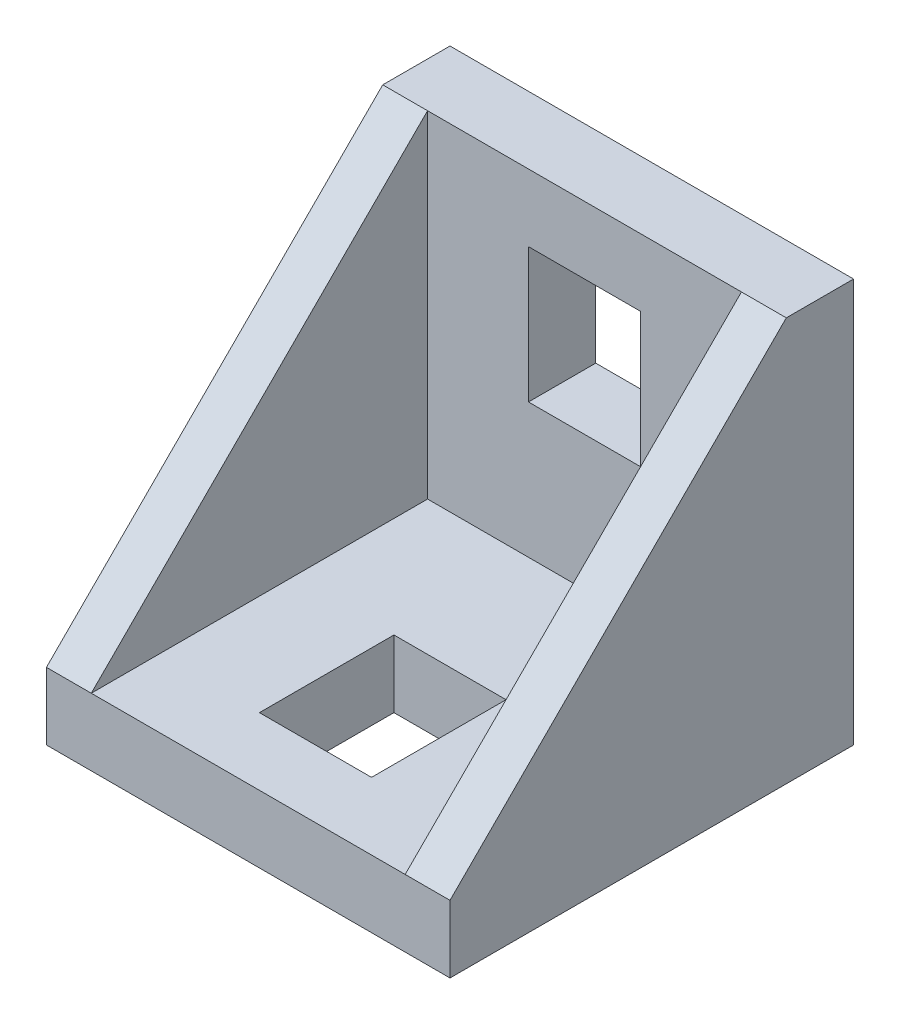
ISO-10303-21;
HEADER;
FILE_DESCRIPTION(('STEP AP214'),'2;1');
FILE_NAME('part.step','',(''),(''),'','','');
FILE_SCHEMA(('AUTOMOTIVE_DESIGN { 1 0 10303 214 1 1 1 1 }'));
ENDSEC;
DATA;
#1=APPLICATION_CONTEXT('core data for automotive mechanical design processes');
#2=APPLICATION_PROTOCOL_DEFINITION('international standard','automotive_design',2000,#1);
#3=PRODUCT_CONTEXT('',#1,'mechanical');
#4=PRODUCT('Part','Part','',(#3));
#5=PRODUCT_RELATED_PRODUCT_CATEGORY('part','',(#4));
#6=PRODUCT_DEFINITION_FORMATION('','',#4);
#7=PRODUCT_DEFINITION_CONTEXT('part definition',#1,'design');
#8=PRODUCT_DEFINITION('design','',#6,#7);
#9=PRODUCT_DEFINITION_SHAPE('','',#8);
#10=(LENGTH_UNIT() NAMED_UNIT(*) SI_UNIT(.MILLI.,.METRE.));
#11=(NAMED_UNIT(*) PLANE_ANGLE_UNIT() SI_UNIT($,.RADIAN.));
#12=(NAMED_UNIT(*) SI_UNIT($,.STERADIAN.) SOLID_ANGLE_UNIT());
#13=UNCERTAINTY_MEASURE_WITH_UNIT(LENGTH_MEASURE(1.E-05),#10,'distance_accuracy_value','');
#14=(GEOMETRIC_REPRESENTATION_CONTEXT(3) GLOBAL_UNCERTAINTY_ASSIGNED_CONTEXT((#13)) GLOBAL_UNIT_ASSIGNED_CONTEXT((#10,
#11,#12)) REPRESENTATION_CONTEXT('',''));
#15=CARTESIAN_POINT('',(0.,0.,0.));
#16=DIRECTION('',(0.,0.,1.));
#17=DIRECTION('',(1.,0.,0.));
#18=AXIS2_PLACEMENT_3D('',#15,#16,#17);
#19=CARTESIAN_POINT('',(0.,18.,3.));
#20=DIRECTION('',(0.,0.,-1.));
#21=DIRECTION('',(-1.,0.,0.));
#22=AXIS2_PLACEMENT_3D('',#19,#20,#21);
#23=PLANE('',#22);
#24=DIRECTION('',(-1.,0.,0.));
#25=VECTOR('',#24,1.);
#26=CARTESIAN_POINT('',(11.5,15.,3.));
#27=LINE('',#26,#25);
#28=CARTESIAN_POINT('',(11.5,15.,3.));
#29=VERTEX_POINT('',#28);
#30=CARTESIAN_POINT('',(6.5,15.,3.));
#31=VERTEX_POINT('',#30);
#32=EDGE_CURVE('E164',#29,#31,#27,.T.);
#33=ORIENTED_EDGE('',*,*,#32,.F.);
#34=DIRECTION('',(0.,1.,0.));
#35=VECTOR('',#34,1.);
#36=CARTESIAN_POINT('',(11.5,15.,3.));
#37=LINE('',#36,#35);
#38=CARTESIAN_POINT('',(11.5,9.,3.));
#39=VERTEX_POINT('',#38);
#40=EDGE_CURVE('E47',#39,#29,#37,.T.);
#41=ORIENTED_EDGE('',*,*,#40,.F.);
#42=DIRECTION('',(1.,0.,0.));
#43=VECTOR('',#42,1.);
#44=CARTESIAN_POINT('',(11.5,9.,3.));
#45=LINE('',#44,#43);
#46=CARTESIAN_POINT('',(6.5,9.,3.));
#47=VERTEX_POINT('',#46);
#48=EDGE_CURVE('E157',#47,#39,#45,.T.);
#49=ORIENTED_EDGE('',*,*,#48,.F.);
#50=DIRECTION('',(0.,-1.,0.));
#51=VECTOR('',#50,1.);
#52=CARTESIAN_POINT('',(6.5,9.,3.));
#53=LINE('',#52,#51);
#54=EDGE_CURVE('E171',#31,#47,#53,.T.);
#55=ORIENTED_EDGE('',*,*,#54,.F.);
#56=EDGE_LOOP('',(#33,#41,#49,#55));
#57=FACE_BOUND('',#56,.T.);
#58=DIRECTION('',(0.,-1.,0.));
#59=VECTOR('',#58,1.);
#60=CARTESIAN_POINT('',(2.,3.,3.));
#61=LINE('',#60,#59);
#62=CARTESIAN_POINT('',(2.,18.,3.));
#63=VERTEX_POINT('',#62);
#64=CARTESIAN_POINT('',(2.,3.,3.));
#65=VERTEX_POINT('',#64);
#66=EDGE_CURVE('E211',#63,#65,#61,.T.);
#67=ORIENTED_EDGE('',*,*,#66,.T.);
#68=DIRECTION('',(-1.,0.,0.));
#69=VECTOR('',#68,1.);
#70=CARTESIAN_POINT('',(0.,3.,3.));
#71=LINE('',#70,#69);
#72=CARTESIAN_POINT('',(16.,3.,3.));
#73=VERTEX_POINT('',#72);
#74=EDGE_CURVE('E34',#73,#65,#71,.T.);
#75=ORIENTED_EDGE('',*,*,#74,.F.);
#76=DIRECTION('',(0.,1.,0.));
#77=VECTOR('',#76,1.);
#78=CARTESIAN_POINT('',(16.,3.,3.));
#79=LINE('',#78,#77);
#80=CARTESIAN_POINT('',(16.,18.,3.));
#81=VERTEX_POINT('',#80);
#82=EDGE_CURVE('E228',#73,#81,#79,.T.);
#83=ORIENTED_EDGE('',*,*,#82,.T.);
#84=DIRECTION('',(-1.,0.,0.));
#85=VECTOR('',#84,1.);
#86=CARTESIAN_POINT('',(0.,18.,3.));
#87=LINE('',#86,#85);
#88=EDGE_CURVE('E257',#81,#63,#87,.T.);
#89=ORIENTED_EDGE('',*,*,#88,.T.);
#90=EDGE_LOOP('',(#67,#75,#83,#89));
#91=FACE_BOUND('',#90,.T.);
#92=ADVANCED_FACE('F30',(#57,#91),#23,.F.);
#93=CARTESIAN_POINT('',(0.,3.,18.));
#94=DIRECTION('',(0.,-1.,0.));
#95=DIRECTION('',(0.,0.,-1.));
#96=AXIS2_PLACEMENT_3D('',#93,#94,#95);
#97=PLANE('',#96);
#98=DIRECTION('',(0.,0.,-1.));
#99=VECTOR('',#98,1.);
#100=CARTESIAN_POINT('',(11.5,3.,9.));
#101=LINE('',#100,#99);
#102=CARTESIAN_POINT('',(11.5,3.,15.));
#103=VERTEX_POINT('',#102);
#104=CARTESIAN_POINT('',(11.5,3.,9.));
#105=VERTEX_POINT('',#104);
#106=EDGE_CURVE('E189',#103,#105,#101,.T.);
#107=ORIENTED_EDGE('',*,*,#106,.F.);
#108=DIRECTION('',(1.,0.,0.));
#109=VECTOR('',#108,1.);
#110=CARTESIAN_POINT('',(11.5,3.,15.));
#111=LINE('',#110,#109);
#112=CARTESIAN_POINT('',(6.5,3.,15.));
#113=VERTEX_POINT('',#112);
#114=EDGE_CURVE('E187',#113,#103,#111,.T.);
#115=ORIENTED_EDGE('',*,*,#114,.F.);
#116=DIRECTION('',(0.,0.,1.));
#117=VECTOR('',#116,1.);
#118=CARTESIAN_POINT('',(6.5,3.,15.));
#119=LINE('',#118,#117);
#120=CARTESIAN_POINT('',(6.5,3.,9.));
#121=VERTEX_POINT('',#120);
#122=EDGE_CURVE('E195',#121,#113,#119,.T.);
#123=ORIENTED_EDGE('',*,*,#122,.F.);
#124=DIRECTION('',(-1.,0.,0.));
#125=VECTOR('',#124,1.);
#126=CARTESIAN_POINT('',(11.5,3.,9.));
#127=LINE('',#126,#125);
#128=EDGE_CURVE('E192',#105,#121,#127,.T.);
#129=ORIENTED_EDGE('',*,*,#128,.F.);
#130=EDGE_LOOP('',(#107,#115,#123,#129));
#131=FACE_BOUND('',#130,.T.);
#132=DIRECTION('',(0.,0.,1.));
#133=VECTOR('',#132,1.);
#134=CARTESIAN_POINT('',(2.,3.,18.));
#135=LINE('',#134,#133);
#136=CARTESIAN_POINT('',(2.,3.,18.));
#137=VERTEX_POINT('',#136);
#138=EDGE_CURVE('E214',#65,#137,#135,.T.);
#139=ORIENTED_EDGE('',*,*,#138,.T.);
#140=DIRECTION('',(-1.,0.,0.));
#141=VECTOR('',#140,1.);
#142=CARTESIAN_POINT('',(0.,3.,18.));
#143=LINE('',#142,#141);
#144=CARTESIAN_POINT('',(16.,3.,18.));
#145=VERTEX_POINT('',#144);
#146=EDGE_CURVE('E248',#145,#137,#143,.T.);
#147=ORIENTED_EDGE('',*,*,#146,.F.);
#148=DIRECTION('',(0.,0.,-1.));
#149=VECTOR('',#148,1.);
#150=CARTESIAN_POINT('',(16.,3.,18.));
#151=LINE('',#150,#149);
#152=EDGE_CURVE('E234',#145,#73,#151,.T.);
#153=ORIENTED_EDGE('',*,*,#152,.T.);
#154=ORIENTED_EDGE('',*,*,#74,.T.);
#155=EDGE_LOOP('',(#139,#147,#153,#154));
#156=FACE_BOUND('',#155,.T.);
#157=ADVANCED_FACE('F296',(#131,#156),#97,.F.);
#158=CARTESIAN_POINT('',(0.,0.,3.));
#159=DIRECTION('',(1.,0.,0.));
#160=DIRECTION('',(0.,0.,-1.));
#161=AXIS2_PLACEMENT_3D('',#158,#159,#160);
#162=PLANE('',#161);
#163=DIRECTION('',(0.,-1.,0.));
#164=VECTOR('',#163,1.);
#165=CARTESIAN_POINT('',(0.,0.,0.));
#166=LINE('',#165,#164);
#167=CARTESIAN_POINT('',(0.,18.,0.));
#168=VERTEX_POINT('',#167);
#169=CARTESIAN_POINT('',(0.,0.,0.));
#170=VERTEX_POINT('',#169);
#171=EDGE_CURVE('E251',#168,#170,#166,.T.);
#172=ORIENTED_EDGE('',*,*,#171,.T.);
#173=DIRECTION('',(0.,0.,-1.));
#174=VECTOR('',#173,1.);
#175=CARTESIAN_POINT('',(0.,0.,3.));
#176=LINE('',#175,#174);
#177=CARTESIAN_POINT('',(0.,0.,18.));
#178=VERTEX_POINT('',#177);
#179=EDGE_CURVE('E11',#178,#170,#176,.T.);
#180=ORIENTED_EDGE('',*,*,#179,.F.);
#181=DIRECTION('',(0.,-1.,0.));
#182=VECTOR('',#181,1.);
#183=CARTESIAN_POINT('',(0.,0.,18.));
#184=LINE('',#183,#182);
#185=CARTESIAN_POINT('',(0.,3.,18.));
#186=VERTEX_POINT('',#185);
#187=EDGE_CURVE('E239',#186,#178,#184,.T.);
#188=ORIENTED_EDGE('',*,*,#187,.F.);
#189=DIRECTION('',(0.,0.707106781186547,-0.707106781186547));
#190=VECTOR('',#189,1.);
#191=CARTESIAN_POINT('',(0.,18.,3.));
#192=LINE('',#191,#190);
#193=CARTESIAN_POINT('',(0.,18.,3.));
#194=VERTEX_POINT('',#193);
#195=EDGE_CURVE('E210',#186,#194,#192,.T.);
#196=ORIENTED_EDGE('',*,*,#195,.T.);
#197=DIRECTION('',(0.,0.,-1.));
#198=VECTOR('',#197,1.);
#199=CARTESIAN_POINT('',(0.,18.,3.));
#200=LINE('',#199,#198);
#201=EDGE_CURVE('E256',#194,#168,#200,.T.);
#202=ORIENTED_EDGE('',*,*,#201,.T.);
#203=EDGE_LOOP('',(#172,#180,#188,#196,#202));
#204=FACE_BOUND('',#203,.T.);
#205=ADVANCED_FACE('F32',(#204),#162,.F.);
#206=CARTESIAN_POINT('',(0.,0.,3.));
#207=DIRECTION('',(0.,1.,0.));
#208=DIRECTION('',(0.,0.,1.));
#209=AXIS2_PLACEMENT_3D('',#206,#207,#208);
#210=PLANE('',#209);
#211=DIRECTION('',(0.,0.,-1.));
#212=VECTOR('',#211,1.);
#213=CARTESIAN_POINT('',(6.5,0.,15.));
#214=LINE('',#213,#212);
#215=CARTESIAN_POINT('',(6.5,0.,15.));
#216=VERTEX_POINT('',#215);
#217=CARTESIAN_POINT('',(6.5,0.,9.));
#218=VERTEX_POINT('',#217);
#219=EDGE_CURVE('E181',#216,#218,#214,.T.);
#220=ORIENTED_EDGE('',*,*,#219,.F.);
#221=DIRECTION('',(-1.,0.,0.));
#222=VECTOR('',#221,1.);
#223=CARTESIAN_POINT('',(11.5,0.,15.));
#224=LINE('',#223,#222);
#225=CARTESIAN_POINT('',(11.5,0.,15.));
#226=VERTEX_POINT('',#225);
#227=EDGE_CURVE('E184',#226,#216,#224,.T.);
#228=ORIENTED_EDGE('',*,*,#227,.F.);
#229=DIRECTION('',(0.,0.,1.));
#230=VECTOR('',#229,1.);
#231=CARTESIAN_POINT('',(11.5,0.,9.));
#232=LINE('',#231,#230);
#233=CARTESIAN_POINT('',(11.5,0.,9.));
#234=VERTEX_POINT('',#233);
#235=EDGE_CURVE('E201',#234,#226,#232,.T.);
#236=ORIENTED_EDGE('',*,*,#235,.F.);
#237=DIRECTION('',(1.,0.,0.));
#238=VECTOR('',#237,1.);
#239=CARTESIAN_POINT('',(11.5,0.,9.));
#240=LINE('',#239,#238);
#241=EDGE_CURVE('E151',#218,#234,#240,.T.);
#242=ORIENTED_EDGE('',*,*,#241,.F.);
#243=EDGE_LOOP('',(#220,#228,#236,#242));
#244=FACE_BOUND('',#243,.T.);
#245=DIRECTION('',(1.,0.,0.));
#246=VECTOR('',#245,1.);
#247=CARTESIAN_POINT('',(0.,0.,0.));
#248=LINE('',#247,#246);
#249=CARTESIAN_POINT('',(18.,0.,0.));
#250=VERTEX_POINT('',#249);
#251=EDGE_CURVE('E260',#170,#250,#248,.T.);
#252=ORIENTED_EDGE('',*,*,#251,.T.);
#253=DIRECTION('',(0.,0.,-1.));
#254=VECTOR('',#253,1.);
#255=CARTESIAN_POINT('',(18.,0.,3.));
#256=LINE('',#255,#254);
#257=CARTESIAN_POINT('',(18.,0.,18.));
#258=VERTEX_POINT('',#257);
#259=EDGE_CURVE('E40',#258,#250,#256,.T.);
#260=ORIENTED_EDGE('',*,*,#259,.F.);
#261=DIRECTION('',(1.,0.,0.));
#262=VECTOR('',#261,1.);
#263=CARTESIAN_POINT('',(0.,0.,18.));
#264=LINE('',#263,#262);
#265=EDGE_CURVE('E242',#178,#258,#264,.T.);
#266=ORIENTED_EDGE('',*,*,#265,.F.);
#267=ORIENTED_EDGE('',*,*,#179,.T.);
#268=EDGE_LOOP('',(#252,#260,#266,#267));
#269=FACE_BOUND('',#268,.T.);
#270=ADVANCED_FACE('F332',(#244,#269),#210,.F.);
#271=CARTESIAN_POINT('',(18.,0.,3.));
#272=DIRECTION('',(-1.,0.,0.));
#273=DIRECTION('',(0.,0.,1.));
#274=AXIS2_PLACEMENT_3D('',#271,#272,#273);
#275=PLANE('',#274);
#276=DIRECTION('',(0.,0.,-1.));
#277=VECTOR('',#276,1.);
#278=CARTESIAN_POINT('',(18.,18.,3.));
#279=LINE('',#278,#277);
#280=CARTESIAN_POINT('',(18.,18.,3.));
#281=VERTEX_POINT('',#280);
#282=CARTESIAN_POINT('',(18.,18.,0.));
#283=VERTEX_POINT('',#282);
#284=EDGE_CURVE('E268',#281,#283,#279,.T.);
#285=ORIENTED_EDGE('',*,*,#284,.F.);
#286=DIRECTION('',(0.,-0.707106781186547,0.707106781186547));
#287=VECTOR('',#286,1.);
#288=CARTESIAN_POINT('',(18.,18.,3.));
#289=LINE('',#288,#287);
#290=CARTESIAN_POINT('',(18.,3.,18.));
#291=VERTEX_POINT('',#290);
#292=EDGE_CURVE('E225',#281,#291,#289,.T.);
#293=ORIENTED_EDGE('',*,*,#292,.T.);
#294=DIRECTION('',(0.,1.,0.));
#295=VECTOR('',#294,1.);
#296=CARTESIAN_POINT('',(18.,0.,18.));
#297=LINE('',#296,#295);
#298=EDGE_CURVE('E245',#258,#291,#297,.T.);
#299=ORIENTED_EDGE('',*,*,#298,.F.);
#300=ORIENTED_EDGE('',*,*,#259,.T.);
#301=DIRECTION('',(0.,1.,0.));
#302=VECTOR('',#301,1.);
#303=CARTESIAN_POINT('',(18.,0.,0.));
#304=LINE('',#303,#302);
#305=EDGE_CURVE('E262',#250,#283,#304,.T.);
#306=ORIENTED_EDGE('',*,*,#305,.T.);
#307=EDGE_LOOP('',(#285,#293,#299,#300,#306));
#308=FACE_BOUND('',#307,.T.);
#309=ADVANCED_FACE('F276',(#308),#275,.F.);
#310=CARTESIAN_POINT('',(0.,18.,3.));
#311=DIRECTION('',(0.,-1.,0.));
#312=DIRECTION('',(0.,0.,-1.));
#313=AXIS2_PLACEMENT_3D('',#310,#311,#312);
#314=PLANE('',#313);
#315=DIRECTION('',(-1.,0.,0.));
#316=VECTOR('',#315,1.);
#317=CARTESIAN_POINT('',(0.,18.,0.));
#318=LINE('',#317,#316);
#319=EDGE_CURVE('E264',#283,#168,#318,.T.);
#320=ORIENTED_EDGE('',*,*,#319,.T.);
#321=ORIENTED_EDGE('',*,*,#201,.F.);
#322=DIRECTION('',(-1.,0.,0.));
#323=VECTOR('',#322,1.);
#324=CARTESIAN_POINT('',(2.,18.,3.));
#325=LINE('',#324,#323);
#326=EDGE_CURVE('E223',#63,#194,#325,.T.);
#327=ORIENTED_EDGE('',*,*,#326,.F.);
#328=ORIENTED_EDGE('',*,*,#88,.F.);
#329=EDGE_CURVE('E254',#281,#81,#87,.T.);
#330=ORIENTED_EDGE('',*,*,#329,.F.);
#331=ORIENTED_EDGE('',*,*,#284,.T.);
#332=EDGE_LOOP('',(#320,#321,#327,#328,#330,#331));
#333=FACE_BOUND('',#332,.T.);
#334=ADVANCED_FACE('F283',(#333),#314,.F.);
#335=CARTESIAN_POINT('',(0.,18.,0.));
#336=DIRECTION('',(0.,0.,-1.));
#337=DIRECTION('',(-1.,0.,0.));
#338=AXIS2_PLACEMENT_3D('',#335,#336,#337);
#339=PLANE('',#338);
#340=DIRECTION('',(0.,1.,0.));
#341=VECTOR('',#340,1.);
#342=CARTESIAN_POINT('',(11.5,15.,0.));
#343=LINE('',#342,#341);
#344=CARTESIAN_POINT('',(11.5,9.,0.));
#345=VERTEX_POINT('',#344);
#346=CARTESIAN_POINT('',(11.5,15.,0.));
#347=VERTEX_POINT('',#346);
#348=EDGE_CURVE('E155',#345,#347,#343,.T.);
#349=ORIENTED_EDGE('',*,*,#348,.T.);
#350=DIRECTION('',(-1.,0.,0.));
#351=VECTOR('',#350,1.);
#352=CARTESIAN_POINT('',(11.5,15.,0.));
#353=LINE('',#352,#351);
#354=CARTESIAN_POINT('',(6.5,15.,0.));
#355=VERTEX_POINT('',#354);
#356=EDGE_CURVE('E144',#347,#355,#353,.T.);
#357=ORIENTED_EDGE('',*,*,#356,.T.);
#358=DIRECTION('',(0.,-1.,0.));
#359=VECTOR('',#358,1.);
#360=CARTESIAN_POINT('',(6.5,9.,0.));
#361=LINE('',#360,#359);
#362=CARTESIAN_POINT('',(6.5,9.,0.));
#363=VERTEX_POINT('',#362);
#364=EDGE_CURVE('E166',#355,#363,#361,.T.);
#365=ORIENTED_EDGE('',*,*,#364,.T.);
#366=DIRECTION('',(1.,0.,0.));
#367=VECTOR('',#366,1.);
#368=CARTESIAN_POINT('',(11.5,9.,0.));
#369=LINE('',#368,#367);
#370=EDGE_CURVE('E162',#363,#345,#369,.T.);
#371=ORIENTED_EDGE('',*,*,#370,.T.);
#372=EDGE_LOOP('',(#349,#357,#365,#371));
#373=FACE_BOUND('',#372,.T.);
#374=ORIENTED_EDGE('',*,*,#171,.F.);
#375=ORIENTED_EDGE('',*,*,#319,.F.);
#376=ORIENTED_EDGE('',*,*,#305,.F.);
#377=ORIENTED_EDGE('',*,*,#251,.F.);
#378=EDGE_LOOP('',(#374,#375,#376,#377));
#379=FACE_BOUND('',#378,.T.);
#380=ADVANCED_FACE('F160',(#373,#379),#339,.T.);
#381=CARTESIAN_POINT('',(0.,3.,18.));
#382=DIRECTION('',(0.,0.,-1.));
#383=DIRECTION('',(-1.,0.,0.));
#384=AXIS2_PLACEMENT_3D('',#381,#382,#383);
#385=PLANE('',#384);
#386=ORIENTED_EDGE('',*,*,#187,.T.);
#387=ORIENTED_EDGE('',*,*,#265,.T.);
#388=ORIENTED_EDGE('',*,*,#298,.T.);
#389=EDGE_CURVE('E249',#291,#145,#143,.T.);
#390=ORIENTED_EDGE('',*,*,#389,.T.);
#391=ORIENTED_EDGE('',*,*,#146,.T.);
#392=DIRECTION('',(-1.,0.,0.));
#393=VECTOR('',#392,1.);
#394=CARTESIAN_POINT('',(2.,3.,18.));
#395=LINE('',#394,#393);
#396=EDGE_CURVE('E220',#137,#186,#395,.T.);
#397=ORIENTED_EDGE('',*,*,#396,.T.);
#398=EDGE_LOOP('',(#386,#387,#388,#390,#391,#397));
#399=FACE_BOUND('',#398,.T.);
#400=ADVANCED_FACE('F293',(#399),#385,.F.);
#401=CARTESIAN_POINT('',(16.,18.,3.));
#402=DIRECTION('',(0.,0.707106781186547,0.707106781186547));
#403=DIRECTION('',(0.,-0.707106781186548,0.707106781186548));
#404=AXIS2_PLACEMENT_3D('',#401,#402,#403);
#405=PLANE('',#404);
#406=ORIENTED_EDGE('',*,*,#292,.F.);
#407=ORIENTED_EDGE('',*,*,#329,.T.);
#408=DIRECTION('',(0.,-0.707106781186547,0.707106781186547));
#409=VECTOR('',#408,1.);
#410=CARTESIAN_POINT('',(16.,18.,3.));
#411=LINE('',#410,#409);
#412=EDGE_CURVE('E231',#81,#145,#411,.T.);
#413=ORIENTED_EDGE('',*,*,#412,.T.);
#414=ORIENTED_EDGE('',*,*,#389,.F.);
#415=EDGE_LOOP('',(#406,#407,#413,#414));
#416=FACE_BOUND('',#415,.T.);
#417=ADVANCED_FACE('F306',(#416),#405,.T.);
#418=CARTESIAN_POINT('',(16.,3.,3.));
#419=DIRECTION('',(-1.,0.,0.));
#420=DIRECTION('',(0.,0.,1.));
#421=AXIS2_PLACEMENT_3D('',#418,#419,#420);
#422=PLANE('',#421);
#423=ORIENTED_EDGE('',*,*,#82,.F.);
#424=ORIENTED_EDGE('',*,*,#152,.F.);
#425=ORIENTED_EDGE('',*,*,#412,.F.);
#426=EDGE_LOOP('',(#423,#424,#425));
#427=FACE_BOUND('',#426,.T.);
#428=ADVANCED_FACE('F308',(#427),#422,.T.);
#429=CARTESIAN_POINT('',(2.,18.,3.));
#430=DIRECTION('',(0.,0.707106781186547,0.707106781186547));
#431=DIRECTION('',(0.,-0.707106781186548,0.707106781186548));
#432=AXIS2_PLACEMENT_3D('',#429,#430,#431);
#433=PLANE('',#432);
#434=ORIENTED_EDGE('',*,*,#195,.F.);
#435=ORIENTED_EDGE('',*,*,#396,.F.);
#436=DIRECTION('',(0.,0.707106781186547,-0.707106781186547));
#437=VECTOR('',#436,1.);
#438=CARTESIAN_POINT('',(2.,18.,3.));
#439=LINE('',#438,#437);
#440=EDGE_CURVE('E217',#137,#63,#439,.T.);
#441=ORIENTED_EDGE('',*,*,#440,.T.);
#442=ORIENTED_EDGE('',*,*,#326,.T.);
#443=EDGE_LOOP('',(#434,#435,#441,#442));
#444=FACE_BOUND('',#443,.T.);
#445=ADVANCED_FACE('F289',(#444),#433,.T.);
#446=CARTESIAN_POINT('',(2.,3.,3.));
#447=DIRECTION('',(-1.,0.,0.));
#448=DIRECTION('',(0.,0.,1.));
#449=AXIS2_PLACEMENT_3D('',#446,#447,#448);
#450=PLANE('',#449);
#451=ORIENTED_EDGE('',*,*,#66,.F.);
#452=ORIENTED_EDGE('',*,*,#440,.F.);
#453=ORIENTED_EDGE('',*,*,#138,.F.);
#454=EDGE_LOOP('',(#451,#452,#453));
#455=FACE_BOUND('',#454,.T.);
#456=ADVANCED_FACE('F300',(#455),#450,.F.);
#457=CARTESIAN_POINT('',(11.5,-0.00100000000000013,15.));
#458=DIRECTION('',(0.,0.,1.));
#459=DIRECTION('',(1.,0.,0.));
#460=AXIS2_PLACEMENT_3D('',#457,#458,#459);
#461=PLANE('',#460);
#462=ORIENTED_EDGE('',*,*,#227,.T.);
#463=DIRECTION('',(0.,1.,0.));
#464=VECTOR('',#463,1.);
#465=CARTESIAN_POINT('',(6.5,-0.00100000000000013,15.));
#466=LINE('',#465,#464);
#467=EDGE_CURVE('E199',#216,#113,#466,.T.);
#468=ORIENTED_EDGE('',*,*,#467,.T.);
#469=ORIENTED_EDGE('',*,*,#114,.T.);
#470=DIRECTION('',(0.,1.,0.));
#471=VECTOR('',#470,1.);
#472=CARTESIAN_POINT('',(11.5,-0.00100000000000013,15.));
#473=LINE('',#472,#471);
#474=EDGE_CURVE('E198',#226,#103,#473,.T.);
#475=ORIENTED_EDGE('',*,*,#474,.F.);
#476=EDGE_LOOP('',(#462,#468,#469,#475));
#477=FACE_BOUND('',#476,.T.);
#478=ADVANCED_FACE('F347',(#477),#461,.F.);
#479=CARTESIAN_POINT('',(6.5,-0.00100000000000013,15.));
#480=DIRECTION('',(-1.,0.,0.));
#481=DIRECTION('',(0.,0.,1.));
#482=AXIS2_PLACEMENT_3D('',#479,#480,#481);
#483=PLANE('',#482);
#484=ORIENTED_EDGE('',*,*,#219,.T.);
#485=DIRECTION('',(0.,1.,0.));
#486=VECTOR('',#485,1.);
#487=CARTESIAN_POINT('',(6.5,-0.00100000000000013,9.));
#488=LINE('',#487,#486);
#489=EDGE_CURVE('E202',#218,#121,#488,.T.);
#490=ORIENTED_EDGE('',*,*,#489,.T.);
#491=ORIENTED_EDGE('',*,*,#122,.T.);
#492=ORIENTED_EDGE('',*,*,#467,.F.);
#493=EDGE_LOOP('',(#484,#490,#491,#492));
#494=FACE_BOUND('',#493,.T.);
#495=ADVANCED_FACE('F343',(#494),#483,.F.);
#496=CARTESIAN_POINT('',(11.5,-0.00100000000000013,9.));
#497=DIRECTION('',(0.,0.,-1.));
#498=DIRECTION('',(-1.,0.,0.));
#499=AXIS2_PLACEMENT_3D('',#496,#497,#498);
#500=PLANE('',#499);
#501=ORIENTED_EDGE('',*,*,#241,.T.);
#502=DIRECTION('',(0.,1.,0.));
#503=VECTOR('',#502,1.);
#504=CARTESIAN_POINT('',(11.5,-0.00100000000000013,9.));
#505=LINE('',#504,#503);
#506=EDGE_CURVE('E204',#234,#105,#505,.T.);
#507=ORIENTED_EDGE('',*,*,#506,.T.);
#508=ORIENTED_EDGE('',*,*,#128,.T.);
#509=ORIENTED_EDGE('',*,*,#489,.F.);
#510=EDGE_LOOP('',(#501,#507,#508,#509));
#511=FACE_BOUND('',#510,.T.);
#512=ADVANCED_FACE('F354',(#511),#500,.F.);
#513=CARTESIAN_POINT('',(11.5,-0.00100000000000013,9.));
#514=DIRECTION('',(1.,0.,0.));
#515=DIRECTION('',(0.,0.,-1.));
#516=AXIS2_PLACEMENT_3D('',#513,#514,#515);
#517=PLANE('',#516);
#518=ORIENTED_EDGE('',*,*,#235,.T.);
#519=ORIENTED_EDGE('',*,*,#474,.T.);
#520=ORIENTED_EDGE('',*,*,#106,.T.);
#521=ORIENTED_EDGE('',*,*,#506,.F.);
#522=EDGE_LOOP('',(#518,#519,#520,#521));
#523=FACE_BOUND('',#522,.T.);
#524=ADVANCED_FACE('F351',(#523),#517,.F.);
#525=CARTESIAN_POINT('',(11.5,15.,-0.00100000000000013));
#526=DIRECTION('',(1.,0.,0.));
#527=DIRECTION('',(0.,0.,-1.));
#528=AXIS2_PLACEMENT_3D('',#525,#526,#527);
#529=PLANE('',#528);
#530=DIRECTION('',(0.,0.,1.));
#531=VECTOR('',#530,1.);
#532=CARTESIAN_POINT('',(11.5,9.,-0.00100000000000013));
#533=LINE('',#532,#531);
#534=EDGE_CURVE('E152',#345,#39,#533,.T.);
#535=ORIENTED_EDGE('',*,*,#534,.T.);
#536=ORIENTED_EDGE('',*,*,#40,.T.);
#537=DIRECTION('',(0.,0.,1.));
#538=VECTOR('',#537,1.);
#539=CARTESIAN_POINT('',(11.5,15.,-0.00100000000000013));
#540=LINE('',#539,#538);
#541=EDGE_CURVE('E146',#347,#29,#540,.T.);
#542=ORIENTED_EDGE('',*,*,#541,.F.);
#543=ORIENTED_EDGE('',*,*,#348,.F.);
#544=EDGE_LOOP('',(#535,#536,#542,#543));
#545=FACE_BOUND('',#544,.T.);
#546=ADVANCED_FACE('F154',(#545),#529,.F.);
#547=CARTESIAN_POINT('',(11.5,9.,-0.00100000000000013));
#548=DIRECTION('',(0.,-1.,0.));
#549=DIRECTION('',(0.,0.,-1.));
#550=AXIS2_PLACEMENT_3D('',#547,#548,#549);
#551=PLANE('',#550);
#552=DIRECTION('',(0.,0.,1.));
#553=VECTOR('',#552,1.);
#554=CARTESIAN_POINT('',(6.5,9.,-0.00100000000000013));
#555=LINE('',#554,#553);
#556=EDGE_CURVE('E177',#363,#47,#555,.T.);
#557=ORIENTED_EDGE('',*,*,#556,.T.);
#558=ORIENTED_EDGE('',*,*,#48,.T.);
#559=ORIENTED_EDGE('',*,*,#534,.F.);
#560=ORIENTED_EDGE('',*,*,#370,.F.);
#561=EDGE_LOOP('',(#557,#558,#559,#560));
#562=FACE_BOUND('',#561,.T.);
#563=ADVANCED_FACE('F415',(#562),#551,.F.);
#564=CARTESIAN_POINT('',(6.5,9.,-0.00100000000000013));
#565=DIRECTION('',(-1.,0.,0.));
#566=DIRECTION('',(0.,-1.,0.));
#567=AXIS2_PLACEMENT_3D('',#564,#565,#566);
#568=PLANE('',#567);
#569=DIRECTION('',(0.,0.,1.));
#570=VECTOR('',#569,1.);
#571=CARTESIAN_POINT('',(6.5,15.,-0.00100000000000013));
#572=LINE('',#571,#570);
#573=EDGE_CURVE('E55',#355,#31,#572,.T.);
#574=ORIENTED_EDGE('',*,*,#573,.T.);
#575=ORIENTED_EDGE('',*,*,#54,.T.);
#576=ORIENTED_EDGE('',*,*,#556,.F.);
#577=ORIENTED_EDGE('',*,*,#364,.F.);
#578=EDGE_LOOP('',(#574,#575,#576,#577));
#579=FACE_BOUND('',#578,.T.);
#580=ADVANCED_FACE('F423',(#579),#568,.F.);
#581=CARTESIAN_POINT('',(11.5,15.,-0.00100000000000013));
#582=DIRECTION('',(0.,1.,0.));
#583=DIRECTION('',(0.,0.,1.));
#584=AXIS2_PLACEMENT_3D('',#581,#582,#583);
#585=PLANE('',#584);
#586=ORIENTED_EDGE('',*,*,#541,.T.);
#587=ORIENTED_EDGE('',*,*,#32,.T.);
#588=ORIENTED_EDGE('',*,*,#573,.F.);
#589=ORIENTED_EDGE('',*,*,#356,.F.);
#590=EDGE_LOOP('',(#586,#587,#588,#589));
#591=FACE_BOUND('',#590,.T.);
#592=ADVANCED_FACE('F145',(#591),#585,.F.);
#593=CLOSED_SHELL('',(#92,#157,#205,#270,#309,#334,#380,#400,#417,#428,#445,#456,#478,#495,#512,
#524,#546,#563,#580,#592));
#594=MANIFOLD_SOLID_BREP('B2',#593);
#595=ADVANCED_BREP_SHAPE_REPRESENTATION('',(#18,#594),#14);
#596=SHAPE_DEFINITION_REPRESENTATION(#9,#595);
ENDSEC;
END-ISO-10303-21;
